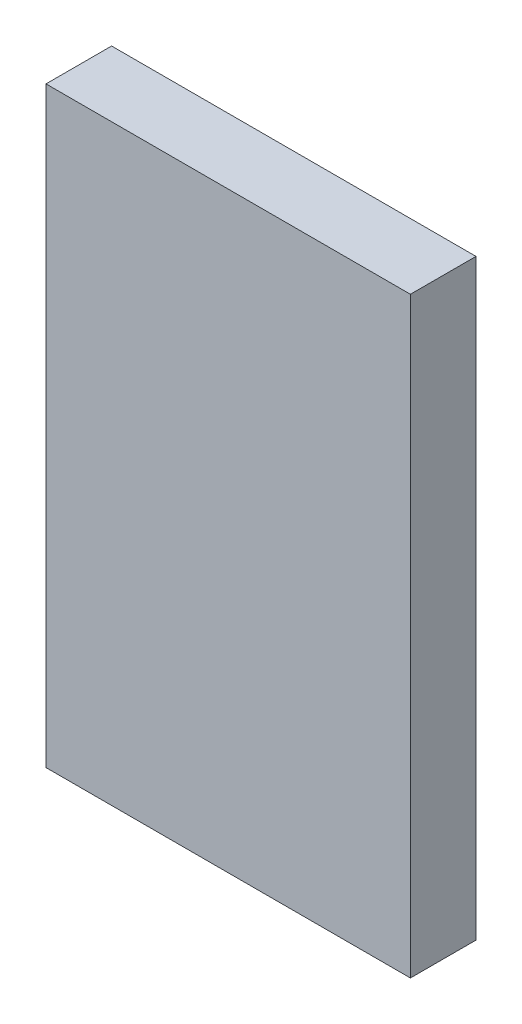
ISO-10303-21;
HEADER;
FILE_DESCRIPTION(('STEP AP214'),'2;1');
FILE_NAME('part.step','',(''),(''),'','','');
FILE_SCHEMA(('AUTOMOTIVE_DESIGN { 1 0 10303 214 1 1 1 1 }'));
ENDSEC;
DATA;
#1=APPLICATION_CONTEXT('core data for automotive mechanical design processes');
#2=APPLICATION_PROTOCOL_DEFINITION('international standard','automotive_design',2000,#1);
#3=PRODUCT_CONTEXT('',#1,'mechanical');
#4=PRODUCT('Part','Part','',(#3));
#5=PRODUCT_RELATED_PRODUCT_CATEGORY('part','',(#4));
#6=PRODUCT_DEFINITION_FORMATION('','',#4);
#7=PRODUCT_DEFINITION_CONTEXT('part definition',#1,'design');
#8=PRODUCT_DEFINITION('design','',#6,#7);
#9=PRODUCT_DEFINITION_SHAPE('','',#8);
#10=(LENGTH_UNIT() NAMED_UNIT(*) SI_UNIT(.MILLI.,.METRE.));
#11=(NAMED_UNIT(*) PLANE_ANGLE_UNIT() SI_UNIT($,.RADIAN.));
#12=(NAMED_UNIT(*) SI_UNIT($,.STERADIAN.) SOLID_ANGLE_UNIT());
#13=UNCERTAINTY_MEASURE_WITH_UNIT(LENGTH_MEASURE(1.E-05),#10,'distance_accuracy_value','');
#14=(GEOMETRIC_REPRESENTATION_CONTEXT(3) GLOBAL_UNCERTAINTY_ASSIGNED_CONTEXT((#13)) GLOBAL_UNIT_ASSIGNED_CONTEXT((#10,
#11,#12)) REPRESENTATION_CONTEXT('',''));
#15=CARTESIAN_POINT('',(0.,0.,0.));
#16=DIRECTION('',(0.,0.,1.));
#17=DIRECTION('',(1.,0.,0.));
#18=AXIS2_PLACEMENT_3D('',#15,#16,#17);
#19=CARTESIAN_POINT('',(0.,0.,7.2));
#20=DIRECTION('',(0.,1.,0.));
#21=DIRECTION('',(0.,0.,1.));
#22=AXIS2_PLACEMENT_3D('',#19,#20,#21);
#23=PLANE('',#22);
#24=DIRECTION('',(1.,0.,0.));
#25=VECTOR('',#24,1.);
#26=CARTESIAN_POINT('',(0.,0.,0.));
#27=LINE('',#26,#25);
#28=CARTESIAN_POINT('',(-40.,0.,0.));
#29=VERTEX_POINT('',#28);
#30=CARTESIAN_POINT('',(0.,0.,0.));
#31=VERTEX_POINT('',#30);
#32=EDGE_CURVE('E113',#29,#31,#27,.T.);
#33=ORIENTED_EDGE('',*,*,#32,.T.);
#34=DIRECTION('',(0.,0.,-1.));
#35=VECTOR('',#34,1.);
#36=CARTESIAN_POINT('',(0.,0.,7.2));
#37=LINE('',#36,#35);
#38=CARTESIAN_POINT('',(0.,0.,7.2));
#39=VERTEX_POINT('',#38);
#40=EDGE_CURVE('E11',#39,#31,#37,.T.);
#41=ORIENTED_EDGE('',*,*,#40,.F.);
#42=DIRECTION('',(1.,0.,0.));
#43=VECTOR('',#42,1.);
#44=CARTESIAN_POINT('',(0.,0.,7.2));
#45=LINE('',#44,#43);
#46=CARTESIAN_POINT('',(-40.,0.,7.2));
#47=VERTEX_POINT('',#46);
#48=EDGE_CURVE('E97',#47,#39,#45,.T.);
#49=ORIENTED_EDGE('',*,*,#48,.F.);
#50=DIRECTION('',(0.,0.,-1.));
#51=VECTOR('',#50,1.);
#52=CARTESIAN_POINT('',(-40.,0.,7.2));
#53=LINE('',#52,#51);
#54=EDGE_CURVE('E109',#47,#29,#53,.T.);
#55=ORIENTED_EDGE('',*,*,#54,.T.);
#56=EDGE_LOOP('',(#33,#41,#49,#55));
#57=FACE_BOUND('',#56,.T.);
#58=ADVANCED_FACE('F45',(#57),#23,.F.);
#59=CARTESIAN_POINT('',(0.,0.,7.2));
#60=DIRECTION('',(-1.,0.,0.));
#61=DIRECTION('',(0.,0.,1.));
#62=AXIS2_PLACEMENT_3D('',#59,#60,#61);
#63=PLANE('',#62);
#64=DIRECTION('',(0.,1.,0.));
#65=VECTOR('',#64,1.);
#66=CARTESIAN_POINT('',(0.,0.,0.));
#67=LINE('',#66,#65);
#68=CARTESIAN_POINT('',(0.,65.,0.));
#69=VERTEX_POINT('',#68);
#70=EDGE_CURVE('E102',#31,#69,#67,.T.);
#71=ORIENTED_EDGE('',*,*,#70,.T.);
#72=DIRECTION('',(0.,0.,-1.));
#73=VECTOR('',#72,1.);
#74=CARTESIAN_POINT('',(0.,65.,7.2));
#75=LINE('',#74,#73);
#76=CARTESIAN_POINT('',(0.,65.,7.2));
#77=VERTEX_POINT('',#76);
#78=EDGE_CURVE('E54',#77,#69,#75,.T.);
#79=ORIENTED_EDGE('',*,*,#78,.F.);
#80=DIRECTION('',(0.,1.,0.));
#81=VECTOR('',#80,1.);
#82=CARTESIAN_POINT('',(0.,0.,7.2));
#83=LINE('',#82,#81);
#84=EDGE_CURVE('E92',#39,#77,#83,.T.);
#85=ORIENTED_EDGE('',*,*,#84,.F.);
#86=ORIENTED_EDGE('',*,*,#40,.T.);
#87=EDGE_LOOP('',(#71,#79,#85,#86));
#88=FACE_BOUND('',#87,.T.);
#89=ADVANCED_FACE('F101',(#88),#63,.F.);
#90=CARTESIAN_POINT('',(0.,65.,7.2));
#91=DIRECTION('',(0.,-1.,0.));
#92=DIRECTION('',(0.,0.,-1.));
#93=AXIS2_PLACEMENT_3D('',#90,#91,#92);
#94=PLANE('',#93);
#95=DIRECTION('',(-1.,0.,0.));
#96=VECTOR('',#95,1.);
#97=CARTESIAN_POINT('',(0.,65.,0.));
#98=LINE('',#97,#96);
#99=CARTESIAN_POINT('',(-40.,65.,0.));
#100=VERTEX_POINT('',#99);
#101=EDGE_CURVE('E79',#69,#100,#98,.T.);
#102=ORIENTED_EDGE('',*,*,#101,.T.);
#103=DIRECTION('',(0.,0.,-1.));
#104=VECTOR('',#103,1.);
#105=CARTESIAN_POINT('',(-40.,65.,7.2));
#106=LINE('',#105,#104);
#107=CARTESIAN_POINT('',(-40.,65.,7.2));
#108=VERTEX_POINT('',#107);
#109=EDGE_CURVE('E104',#108,#100,#106,.T.);
#110=ORIENTED_EDGE('',*,*,#109,.F.);
#111=DIRECTION('',(-1.,0.,0.));
#112=VECTOR('',#111,1.);
#113=CARTESIAN_POINT('',(0.,65.,7.2));
#114=LINE('',#113,#112);
#115=EDGE_CURVE('E95',#77,#108,#114,.T.);
#116=ORIENTED_EDGE('',*,*,#115,.F.);
#117=ORIENTED_EDGE('',*,*,#78,.T.);
#118=EDGE_LOOP('',(#102,#110,#116,#117));
#119=FACE_BOUND('',#118,.T.);
#120=ADVANCED_FACE('F105',(#119),#94,.F.);
#121=CARTESIAN_POINT('',(-40.,0.,7.2));
#122=DIRECTION('',(1.,0.,0.));
#123=DIRECTION('',(0.,0.,-1.));
#124=AXIS2_PLACEMENT_3D('',#121,#122,#123);
#125=PLANE('',#124);
#126=DIRECTION('',(0.,-1.,0.));
#127=VECTOR('',#126,1.);
#128=CARTESIAN_POINT('',(-40.,0.,0.));
#129=LINE('',#128,#127);
#130=EDGE_CURVE('E85',#100,#29,#129,.T.);
#131=ORIENTED_EDGE('',*,*,#130,.T.);
#132=ORIENTED_EDGE('',*,*,#54,.F.);
#133=DIRECTION('',(0.,-1.,0.));
#134=VECTOR('',#133,1.);
#135=CARTESIAN_POINT('',(-40.,0.,7.2));
#136=LINE('',#135,#134);
#137=EDGE_CURVE('E62',#108,#47,#136,.T.);
#138=ORIENTED_EDGE('',*,*,#137,.F.);
#139=ORIENTED_EDGE('',*,*,#109,.T.);
#140=EDGE_LOOP('',(#131,#132,#138,#139));
#141=FACE_BOUND('',#140,.T.);
#142=ADVANCED_FACE('F126',(#141),#125,.F.);
#143=CARTESIAN_POINT('',(0.,0.,7.2));
#144=DIRECTION('',(0.,0.,-1.));
#145=DIRECTION('',(-1.,0.,0.));
#146=AXIS2_PLACEMENT_3D('',#143,#144,#145);
#147=PLANE('',#146);
#148=ORIENTED_EDGE('',*,*,#48,.T.);
#149=ORIENTED_EDGE('',*,*,#84,.T.);
#150=ORIENTED_EDGE('',*,*,#115,.T.);
#151=ORIENTED_EDGE('',*,*,#137,.T.);
#152=EDGE_LOOP('',(#148,#149,#150,#151));
#153=FACE_BOUND('',#152,.T.);
#154=ADVANCED_FACE('F93',(#153),#147,.F.);
#155=CARTESIAN_POINT('',(0.,0.,0.));
#156=DIRECTION('',(0.,0.,-1.));
#157=DIRECTION('',(-1.,0.,0.));
#158=AXIS2_PLACEMENT_3D('',#155,#156,#157);
#159=PLANE('',#158);
#160=ORIENTED_EDGE('',*,*,#32,.F.);
#161=ORIENTED_EDGE('',*,*,#130,.F.);
#162=ORIENTED_EDGE('',*,*,#101,.F.);
#163=ORIENTED_EDGE('',*,*,#70,.F.);
#164=EDGE_LOOP('',(#160,#161,#162,#163));
#165=FACE_BOUND('',#164,.T.);
#166=ADVANCED_FACE('F129',(#165),#159,.T.);
#167=CLOSED_SHELL('',(#58,#89,#120,#142,#154,#166));
#168=MANIFOLD_SOLID_BREP('B2',#167);
#169=ADVANCED_BREP_SHAPE_REPRESENTATION('',(#18,#168),#14);
#170=SHAPE_DEFINITION_REPRESENTATION(#9,#169);
ENDSEC;
END-ISO-10303-21;
